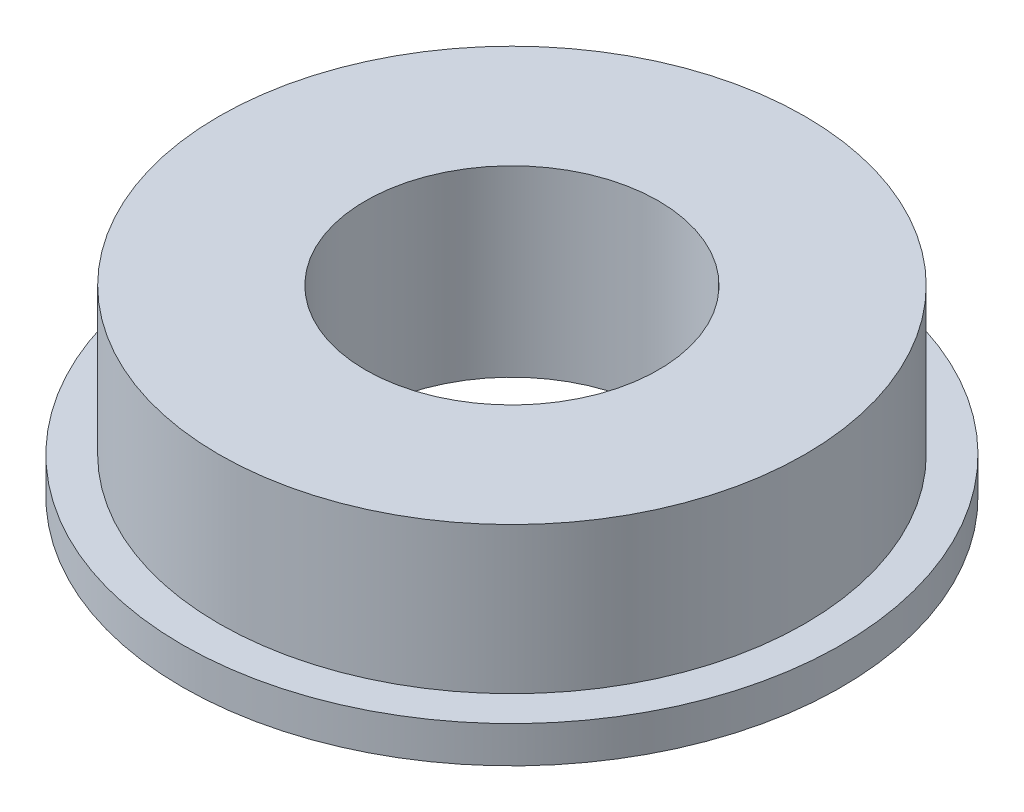
ISO-10303-21;
HEADER;
FILE_DESCRIPTION(('STEP AP214'),'2;1');
FILE_NAME('part.step','',(''),(''),'','','');
FILE_SCHEMA(('AUTOMOTIVE_DESIGN { 1 0 10303 214 1 1 1 1 }'));
ENDSEC;
DATA;
#1=APPLICATION_CONTEXT('core data for automotive mechanical design processes');
#2=APPLICATION_PROTOCOL_DEFINITION('international standard','automotive_design',2000,#1);
#3=PRODUCT_CONTEXT('',#1,'mechanical');
#4=PRODUCT('Part','Part','',(#3));
#5=PRODUCT_RELATED_PRODUCT_CATEGORY('part','',(#4));
#6=PRODUCT_DEFINITION_FORMATION('','',#4);
#7=PRODUCT_DEFINITION_CONTEXT('part definition',#1,'design');
#8=PRODUCT_DEFINITION('design','',#6,#7);
#9=PRODUCT_DEFINITION_SHAPE('','',#8);
#10=(LENGTH_UNIT() NAMED_UNIT(*) SI_UNIT(.MILLI.,.METRE.));
#11=(NAMED_UNIT(*) PLANE_ANGLE_UNIT() SI_UNIT($,.RADIAN.));
#12=(NAMED_UNIT(*) SI_UNIT($,.STERADIAN.) SOLID_ANGLE_UNIT());
#13=UNCERTAINTY_MEASURE_WITH_UNIT(LENGTH_MEASURE(1.E-05),#10,'distance_accuracy_value','');
#14=(GEOMETRIC_REPRESENTATION_CONTEXT(3) GLOBAL_UNCERTAINTY_ASSIGNED_CONTEXT((#13)) GLOBAL_UNIT_ASSIGNED_CONTEXT((#10,
#11,#12)) REPRESENTATION_CONTEXT('',''));
#15=CARTESIAN_POINT('',(0.,0.,0.));
#16=DIRECTION('',(0.,0.,1.));
#17=DIRECTION('',(1.,0.,0.));
#18=AXIS2_PLACEMENT_3D('',#15,#16,#17);
#19=CARTESIAN_POINT('',(0.,5.,0.));
#20=DIRECTION('',(0.,1.,0.));
#21=DIRECTION('',(0.,0.,1.));
#22=AXIS2_PLACEMENT_3D('',#19,#20,#21);
#23=PLANE('',#22);
#24=CARTESIAN_POINT('',(0.,5.,0.));
#25=DIRECTION('',(0.,1.,0.));
#26=DIRECTION('',(0.,0.,1.));
#27=AXIS2_PLACEMENT_3D('',#24,#25,#26);
#28=CIRCLE('',#27,4.);
#29=CARTESIAN_POINT('',(0.,5.,4.));
#30=VERTEX_POINT('',#29);
#31=EDGE_CURVE('E39',#30,#30,#28,.T.);
#32=ORIENTED_EDGE('',*,*,#31,.F.);
#33=EDGE_LOOP('',(#32));
#34=FACE_BOUND('',#33,.T.);
#35=CARTESIAN_POINT('',(0.,5.,0.));
#36=DIRECTION('',(0.,1.,0.));
#37=DIRECTION('',(0.,0.,1.));
#38=AXIS2_PLACEMENT_3D('',#35,#36,#37);
#39=CIRCLE('',#38,8.);
#40=CARTESIAN_POINT('',(0.,5.,8.));
#41=VERTEX_POINT('',#40);
#42=EDGE_CURVE('E53',#41,#41,#39,.T.);
#43=ORIENTED_EDGE('',*,*,#42,.T.);
#44=EDGE_LOOP('',(#43));
#45=FACE_BOUND('',#44,.T.);
#46=ADVANCED_FACE('F32',(#34,#45),#23,.T.);
#47=CARTESIAN_POINT('',(0.,5.,0.));
#48=DIRECTION('',(0.,-1.,0.));
#49=DIRECTION('',(0.,0.,-1.));
#50=AXIS2_PLACEMENT_3D('',#47,#48,#49);
#51=CYLINDRICAL_SURFACE('',#50,9.);
#52=CARTESIAN_POINT('',(0.,0.,0.));
#53=DIRECTION('',(0.,1.,0.));
#54=DIRECTION('',(0.,0.,1.));
#55=AXIS2_PLACEMENT_3D('',#52,#53,#54);
#56=CIRCLE('',#55,9.);
#57=CARTESIAN_POINT('',(0.,0.,9.));
#58=VERTEX_POINT('',#57);
#59=EDGE_CURVE('E10',#58,#58,#56,.T.);
#60=ORIENTED_EDGE('',*,*,#59,.T.);
#61=EDGE_LOOP('',(#60));
#62=FACE_BOUND('',#61,.T.);
#63=CARTESIAN_POINT('',(0.,1.,0.));
#64=DIRECTION('',(0.,1.,0.));
#65=DIRECTION('',(0.,0.,1.));
#66=AXIS2_PLACEMENT_3D('',#63,#64,#65);
#67=CIRCLE('',#66,9.);
#68=CARTESIAN_POINT('',(0.,1.,9.));
#69=VERTEX_POINT('',#68);
#70=EDGE_CURVE('E48',#69,#69,#67,.T.);
#71=ORIENTED_EDGE('',*,*,#70,.F.);
#72=EDGE_LOOP('',(#71));
#73=FACE_BOUND('',#72,.T.);
#74=ADVANCED_FACE('F34',(#62,#73),#51,.T.);
#75=CARTESIAN_POINT('',(0.,0.,0.));
#76=DIRECTION('',(0.,1.,0.));
#77=DIRECTION('',(0.,0.,1.));
#78=AXIS2_PLACEMENT_3D('',#75,#76,#77);
#79=PLANE('',#78);
#80=ORIENTED_EDGE('',*,*,#59,.F.);
#81=EDGE_LOOP('',(#80));
#82=FACE_BOUND('',#81,.T.);
#83=CARTESIAN_POINT('',(0.,0.,0.));
#84=DIRECTION('',(0.,1.,0.));
#85=DIRECTION('',(0.,0.,1.));
#86=AXIS2_PLACEMENT_3D('',#83,#84,#85);
#87=CIRCLE('',#86,4.);
#88=CARTESIAN_POINT('',(0.,0.,4.));
#89=VERTEX_POINT('',#88);
#90=EDGE_CURVE('E43',#89,#89,#87,.T.);
#91=ORIENTED_EDGE('',*,*,#90,.T.);
#92=EDGE_LOOP('',(#91));
#93=FACE_BOUND('',#92,.T.);
#94=ADVANCED_FACE('F70',(#82,#93),#79,.F.);
#95=CARTESIAN_POINT('',(0.,5.,0.));
#96=DIRECTION('',(0.,-1.,0.));
#97=DIRECTION('',(0.,0.,-1.));
#98=AXIS2_PLACEMENT_3D('',#95,#96,#97);
#99=CYLINDRICAL_SURFACE('',#98,4.);
#100=ORIENTED_EDGE('',*,*,#31,.T.);
#101=EDGE_LOOP('',(#100));
#102=FACE_BOUND('',#101,.T.);
#103=ORIENTED_EDGE('',*,*,#90,.F.);
#104=EDGE_LOOP('',(#103));
#105=FACE_BOUND('',#104,.T.);
#106=ADVANCED_FACE('F65',(#102,#105),#99,.F.);
#107=CARTESIAN_POINT('',(0.,1.,0.));
#108=DIRECTION('',(0.,1.,0.));
#109=DIRECTION('',(0.,0.,1.));
#110=AXIS2_PLACEMENT_3D('',#107,#108,#109);
#111=PLANE('',#110);
#112=CARTESIAN_POINT('',(0.,1.,0.));
#113=DIRECTION('',(0.,1.,0.));
#114=DIRECTION('',(0.,0.,1.));
#115=AXIS2_PLACEMENT_3D('',#112,#113,#114);
#116=CIRCLE('',#115,8.);
#117=CARTESIAN_POINT('',(0.,1.,8.));
#118=VERTEX_POINT('',#117);
#119=EDGE_CURVE('E52',#118,#118,#116,.T.);
#120=ORIENTED_EDGE('',*,*,#119,.F.);
#121=EDGE_LOOP('',(#120));
#122=FACE_BOUND('',#121,.T.);
#123=ORIENTED_EDGE('',*,*,#70,.T.);
#124=EDGE_LOOP('',(#123));
#125=FACE_BOUND('',#124,.T.);
#126=ADVANCED_FACE('F62',(#122,#125),#111,.T.);
#127=CARTESIAN_POINT('',(0.,1.,0.));
#128=DIRECTION('',(0.,1.,0.));
#129=DIRECTION('',(0.,0.,1.));
#130=AXIS2_PLACEMENT_3D('',#127,#128,#129);
#131=CYLINDRICAL_SURFACE('',#130,8.);
#132=ORIENTED_EDGE('',*,*,#119,.T.);
#133=EDGE_LOOP('',(#132));
#134=FACE_BOUND('',#133,.T.);
#135=ORIENTED_EDGE('',*,*,#42,.F.);
#136=EDGE_LOOP('',(#135));
#137=FACE_BOUND('',#136,.T.);
#138=ADVANCED_FACE('F59',(#134,#137),#131,.T.);
#139=CLOSED_SHELL('',(#46,#74,#94,#106,#126,#138));
#140=MANIFOLD_SOLID_BREP('B2',#139);
#141=ADVANCED_BREP_SHAPE_REPRESENTATION('',(#18,#140),#14);
#142=SHAPE_DEFINITION_REPRESENTATION(#9,#141);
ENDSEC;
END-ISO-10303-21;
